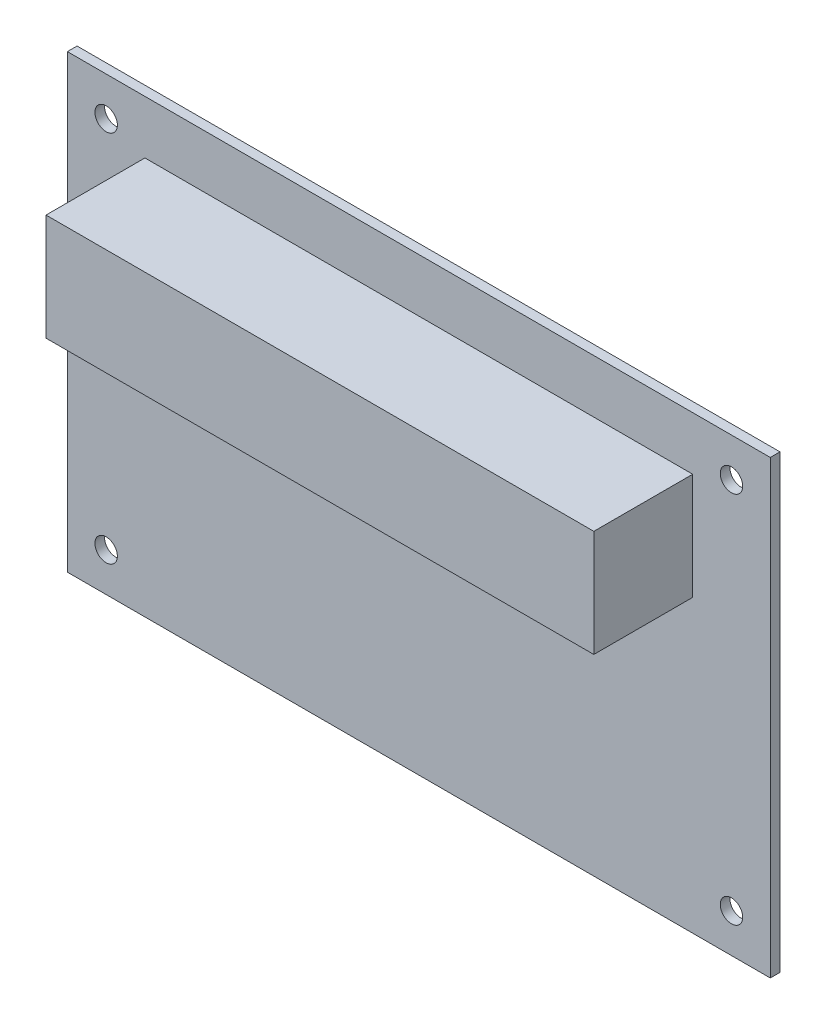
ISO-10303-21;
HEADER;
FILE_DESCRIPTION(('STEP AP214'),'2;1');
FILE_NAME('part.step','',(''),(''),'','','');
FILE_SCHEMA(('AUTOMOTIVE_DESIGN { 1 0 10303 214 1 1 1 1 }'));
ENDSEC;
DATA;
#1=APPLICATION_CONTEXT('core data for automotive mechanical design processes');
#2=APPLICATION_PROTOCOL_DEFINITION('international standard','automotive_design',2000,#1);
#3=PRODUCT_CONTEXT('',#1,'mechanical');
#4=PRODUCT('Part','Part','',(#3));
#5=PRODUCT_RELATED_PRODUCT_CATEGORY('part','',(#4));
#6=PRODUCT_DEFINITION_FORMATION('','',#4);
#7=PRODUCT_DEFINITION_CONTEXT('part definition',#1,'design');
#8=PRODUCT_DEFINITION('design','',#6,#7);
#9=PRODUCT_DEFINITION_SHAPE('','',#8);
#10=(LENGTH_UNIT() NAMED_UNIT(*) SI_UNIT(.MILLI.,.METRE.));
#11=(NAMED_UNIT(*) PLANE_ANGLE_UNIT() SI_UNIT($,.RADIAN.));
#12=(NAMED_UNIT(*) SI_UNIT($,.STERADIAN.) SOLID_ANGLE_UNIT());
#13=UNCERTAINTY_MEASURE_WITH_UNIT(LENGTH_MEASURE(1.E-05),#10,'distance_accuracy_value','');
#14=(GEOMETRIC_REPRESENTATION_CONTEXT(3) GLOBAL_UNCERTAINTY_ASSIGNED_CONTEXT((#13)) GLOBAL_UNIT_ASSIGNED_CONTEXT((#10,
#11,#12)) REPRESENTATION_CONTEXT('',''));
#15=CARTESIAN_POINT('',(0.,0.,0.));
#16=DIRECTION('',(0.,0.,1.));
#17=DIRECTION('',(1.,0.,0.));
#18=AXIS2_PLACEMENT_3D('',#15,#16,#17);
#19=CARTESIAN_POINT('',(0.,0.,1.));
#20=DIRECTION('',(0.,0.,-1.));
#21=DIRECTION('',(-1.,0.,0.));
#22=AXIS2_PLACEMENT_3D('',#19,#20,#21);
#23=PLANE('',#22);
#24=CARTESIAN_POINT('',(-0.272208627681767,4.,1.));
#25=DIRECTION('',(0.,0.,1.));
#26=DIRECTION('',(1.,0.,0.));
#27=AXIS2_PLACEMENT_3D('',#24,#25,#26);
#28=CIRCLE('',#27,1.16);
#29=CARTESIAN_POINT('',(0.887791372318231,4.,1.));
#30=VERTEX_POINT('',#29);
#31=EDGE_CURVE('E128',#30,#30,#28,.T.);
#32=ORIENTED_EDGE('',*,*,#31,.F.);
#33=EDGE_LOOP('',(#32));
#34=FACE_BOUND('',#33,.T.);
#35=CARTESIAN_POINT('',(64.2277913723182,4.,1.));
#36=DIRECTION('',(0.,0.,1.));
#37=DIRECTION('',(1.,0.,0.));
#38=AXIS2_PLACEMENT_3D('',#35,#36,#37);
#39=CIRCLE('',#38,1.15999999999999);
#40=CARTESIAN_POINT('',(65.3877913723182,4.,1.));
#41=VERTEX_POINT('',#40);
#42=EDGE_CURVE('E137',#41,#41,#39,.T.);
#43=ORIENTED_EDGE('',*,*,#42,.F.);
#44=EDGE_LOOP('',(#43));
#45=FACE_BOUND('',#44,.T.);
#46=CARTESIAN_POINT('',(64.2277913723182,42.5,1.));
#47=DIRECTION('',(0.,0.,1.));
#48=DIRECTION('',(1.,0.,0.));
#49=AXIS2_PLACEMENT_3D('',#46,#47,#48);
#50=CIRCLE('',#49,1.15999999999998);
#51=CARTESIAN_POINT('',(65.3877913723182,42.5,1.));
#52=VERTEX_POINT('',#51);
#53=EDGE_CURVE('E143',#52,#52,#50,.T.);
#54=ORIENTED_EDGE('',*,*,#53,.F.);
#55=EDGE_LOOP('',(#54));
#56=FACE_BOUND('',#55,.T.);
#57=CARTESIAN_POINT('',(-0.272208627681767,42.5,1.));
#58=DIRECTION('',(0.,0.,1.));
#59=DIRECTION('',(1.,0.,0.));
#60=AXIS2_PLACEMENT_3D('',#57,#58,#59);
#61=CIRCLE('',#60,1.16);
#62=CARTESIAN_POINT('',(0.887791372318233,42.5,1.));
#63=VERTEX_POINT('',#62);
#64=EDGE_CURVE('E149',#63,#63,#61,.T.);
#65=ORIENTED_EDGE('',*,*,#64,.F.);
#66=EDGE_LOOP('',(#65));
#67=FACE_BOUND('',#66,.T.);
#68=DIRECTION('',(0.,-1.,0.));
#69=VECTOR('',#68,1.);
#70=CARTESIAN_POINT('',(-4.27220862768177,0.,1.));
#71=LINE('',#70,#69);
#72=CARTESIAN_POINT('',(-4.27220862768177,46.5,1.));
#73=VERTEX_POINT('',#72);
#74=CARTESIAN_POINT('',(-4.27220862768177,0.,1.));
#75=VERTEX_POINT('',#74);
#76=EDGE_CURVE('E155',#73,#75,#71,.T.);
#77=ORIENTED_EDGE('',*,*,#76,.T.);
#78=DIRECTION('',(1.,0.,0.));
#79=VECTOR('',#78,1.);
#80=CARTESIAN_POINT('',(-4.27220862768177,0.,1.));
#81=LINE('',#80,#79);
#82=CARTESIAN_POINT('',(68.2277913723182,0.,1.));
#83=VERTEX_POINT('',#82);
#84=EDGE_CURVE('E158',#75,#83,#81,.T.);
#85=ORIENTED_EDGE('',*,*,#84,.T.);
#86=DIRECTION('',(0.,1.,0.));
#87=VECTOR('',#86,1.);
#88=CARTESIAN_POINT('',(68.2277913723182,0.,1.));
#89=LINE('',#88,#87);
#90=CARTESIAN_POINT('',(68.2277913723182,46.5,1.));
#91=VERTEX_POINT('',#90);
#92=EDGE_CURVE('E161',#83,#91,#89,.T.);
#93=ORIENTED_EDGE('',*,*,#92,.T.);
#94=DIRECTION('',(-1.,0.,0.));
#95=VECTOR('',#94,1.);
#96=CARTESIAN_POINT('',(-4.27220862768177,46.5,1.));
#97=LINE('',#96,#95);
#98=EDGE_CURVE('E163',#91,#73,#97,.T.);
#99=ORIENTED_EDGE('',*,*,#98,.T.);
#100=EDGE_LOOP('',(#77,#85,#93,#99));
#101=FACE_BOUND('',#100,.T.);
#102=DIRECTION('',(0.,-1.,0.));
#103=VECTOR('',#102,1.);
#104=CARTESIAN_POINT('',(3.72779137231823,41.,1.));
#105=LINE('',#104,#103);
#106=CARTESIAN_POINT('',(3.72779137231823,41.,1.));
#107=VERTEX_POINT('',#106);
#108=CARTESIAN_POINT('',(3.72779137231823,30.,1.));
#109=VERTEX_POINT('',#108);
#110=EDGE_CURVE('E124',#107,#109,#105,.T.);
#111=ORIENTED_EDGE('',*,*,#110,.F.);
#112=DIRECTION('',(-1.,0.,0.));
#113=VECTOR('',#112,1.);
#114=CARTESIAN_POINT('',(3.72779137231823,41.,1.));
#115=LINE('',#114,#113);
#116=CARTESIAN_POINT('',(60.2277913723182,41.,1.));
#117=VERTEX_POINT('',#116);
#118=EDGE_CURVE('E121',#117,#107,#115,.T.);
#119=ORIENTED_EDGE('',*,*,#118,.F.);
#120=DIRECTION('',(0.,1.,0.));
#121=VECTOR('',#120,1.);
#122=CARTESIAN_POINT('',(60.2277913723182,41.,1.));
#123=LINE('',#122,#121);
#124=CARTESIAN_POINT('',(60.2277913723182,30.,1.));
#125=VERTEX_POINT('',#124);
#126=EDGE_CURVE('E59',#125,#117,#123,.T.);
#127=ORIENTED_EDGE('',*,*,#126,.F.);
#128=DIRECTION('',(1.,0.,0.));
#129=VECTOR('',#128,1.);
#130=CARTESIAN_POINT('',(3.72779137231823,30.,1.));
#131=LINE('',#130,#129);
#132=EDGE_CURVE('E54',#109,#125,#131,.T.);
#133=ORIENTED_EDGE('',*,*,#132,.F.);
#134=EDGE_LOOP('',(#111,#119,#127,#133));
#135=FACE_BOUND('',#134,.T.);
#136=ADVANCED_FACE('F39',(#34,#45,#56,#67,#101,#135),#23,.F.);
#137=CARTESIAN_POINT('',(0.,0.,0.));
#138=DIRECTION('',(0.,0.,-1.));
#139=DIRECTION('',(-1.,0.,0.));
#140=AXIS2_PLACEMENT_3D('',#137,#138,#139);
#141=PLANE('',#140);
#142=CARTESIAN_POINT('',(64.2277913723182,4.,0.));
#143=DIRECTION('',(0.,0.,1.));
#144=DIRECTION('',(1.,0.,0.));
#145=AXIS2_PLACEMENT_3D('',#142,#143,#144);
#146=CIRCLE('',#145,1.15999999999999);
#147=CARTESIAN_POINT('',(65.3877913723182,4.,0.));
#148=VERTEX_POINT('',#147);
#149=EDGE_CURVE('E135',#148,#148,#146,.T.);
#150=ORIENTED_EDGE('',*,*,#149,.T.);
#151=EDGE_LOOP('',(#150));
#152=FACE_BOUND('',#151,.T.);
#153=CARTESIAN_POINT('',(-0.272208627681767,42.5,0.));
#154=DIRECTION('',(0.,0.,1.));
#155=DIRECTION('',(1.,0.,0.));
#156=AXIS2_PLACEMENT_3D('',#153,#154,#155);
#157=CIRCLE('',#156,1.16);
#158=CARTESIAN_POINT('',(0.887791372318233,42.5,0.));
#159=VERTEX_POINT('',#158);
#160=EDGE_CURVE('E146',#159,#159,#157,.T.);
#161=ORIENTED_EDGE('',*,*,#160,.T.);
#162=EDGE_LOOP('',(#161));
#163=FACE_BOUND('',#162,.T.);
#164=DIRECTION('',(0.,-1.,0.));
#165=VECTOR('',#164,1.);
#166=CARTESIAN_POINT('',(-4.27220862768177,0.,0.));
#167=LINE('',#166,#165);
#168=CARTESIAN_POINT('',(-4.27220862768177,46.5,0.));
#169=VERTEX_POINT('',#168);
#170=CARTESIAN_POINT('',(-4.27220862768177,0.,0.));
#171=VERTEX_POINT('',#170);
#172=EDGE_CURVE('E152',#169,#171,#167,.T.);
#173=ORIENTED_EDGE('',*,*,#172,.F.);
#174=DIRECTION('',(-1.,0.,0.));
#175=VECTOR('',#174,1.);
#176=CARTESIAN_POINT('',(-4.27220862768177,46.5,0.));
#177=LINE('',#176,#175);
#178=CARTESIAN_POINT('',(68.2277913723182,46.5,0.));
#179=VERTEX_POINT('',#178);
#180=EDGE_CURVE('E159',#179,#169,#177,.T.);
#181=ORIENTED_EDGE('',*,*,#180,.F.);
#182=DIRECTION('',(0.,1.,0.));
#183=VECTOR('',#182,1.);
#184=CARTESIAN_POINT('',(68.2277913723182,0.,0.));
#185=LINE('',#184,#183);
#186=CARTESIAN_POINT('',(68.2277913723182,0.,0.));
#187=VERTEX_POINT('',#186);
#188=EDGE_CURVE('E170',#187,#179,#185,.T.);
#189=ORIENTED_EDGE('',*,*,#188,.F.);
#190=DIRECTION('',(1.,0.,0.));
#191=VECTOR('',#190,1.);
#192=CARTESIAN_POINT('',(-4.27220862768177,0.,0.));
#193=LINE('',#192,#191);
#194=EDGE_CURVE('E168',#171,#187,#193,.T.);
#195=ORIENTED_EDGE('',*,*,#194,.F.);
#196=EDGE_LOOP('',(#173,#181,#189,#195));
#197=FACE_BOUND('',#196,.T.);
#198=CARTESIAN_POINT('',(64.2277913723182,42.5,0.));
#199=DIRECTION('',(0.,0.,1.));
#200=DIRECTION('',(1.,0.,0.));
#201=AXIS2_PLACEMENT_3D('',#198,#199,#200);
#202=CIRCLE('',#201,1.15999999999998);
#203=CARTESIAN_POINT('',(65.3877913723182,42.5,0.));
#204=VERTEX_POINT('',#203);
#205=EDGE_CURVE('E140',#204,#204,#202,.T.);
#206=ORIENTED_EDGE('',*,*,#205,.T.);
#207=EDGE_LOOP('',(#206));
#208=FACE_BOUND('',#207,.T.);
#209=CARTESIAN_POINT('',(-0.272208627681767,4.,0.));
#210=DIRECTION('',(0.,0.,1.));
#211=DIRECTION('',(1.,0.,0.));
#212=AXIS2_PLACEMENT_3D('',#209,#210,#211);
#213=CIRCLE('',#212,1.16);
#214=CARTESIAN_POINT('',(0.887791372318231,4.,0.));
#215=VERTEX_POINT('',#214);
#216=EDGE_CURVE('E125',#215,#215,#213,.T.);
#217=ORIENTED_EDGE('',*,*,#216,.T.);
#218=EDGE_LOOP('',(#217));
#219=FACE_BOUND('',#218,.T.);
#220=ADVANCED_FACE('F188',(#152,#163,#197,#208,#219),#141,.T.);
#221=CARTESIAN_POINT('',(-4.27220862768177,0.,1.));
#222=DIRECTION('',(1.,0.,0.));
#223=DIRECTION('',(0.,0.,-1.));
#224=AXIS2_PLACEMENT_3D('',#221,#222,#223);
#225=PLANE('',#224);
#226=ORIENTED_EDGE('',*,*,#172,.T.);
#227=DIRECTION('',(0.,0.,-1.));
#228=VECTOR('',#227,1.);
#229=CARTESIAN_POINT('',(-4.27220862768177,0.,1.));
#230=LINE('',#229,#228);
#231=EDGE_CURVE('E11',#75,#171,#230,.T.);
#232=ORIENTED_EDGE('',*,*,#231,.F.);
#233=ORIENTED_EDGE('',*,*,#76,.F.);
#234=DIRECTION('',(0.,0.,-1.));
#235=VECTOR('',#234,1.);
#236=CARTESIAN_POINT('',(-4.27220862768177,46.5,1.));
#237=LINE('',#236,#235);
#238=EDGE_CURVE('E165',#73,#169,#237,.T.);
#239=ORIENTED_EDGE('',*,*,#238,.T.);
#240=EDGE_LOOP('',(#226,#232,#233,#239));
#241=FACE_BOUND('',#240,.T.);
#242=ADVANCED_FACE('F41',(#241),#225,.F.);
#243=CARTESIAN_POINT('',(-4.27220862768177,0.,1.));
#244=DIRECTION('',(0.,1.,0.));
#245=DIRECTION('',(0.,0.,1.));
#246=AXIS2_PLACEMENT_3D('',#243,#244,#245);
#247=PLANE('',#246);
#248=ORIENTED_EDGE('',*,*,#194,.T.);
#249=DIRECTION('',(0.,0.,-1.));
#250=VECTOR('',#249,1.);
#251=CARTESIAN_POINT('',(68.2277913723182,0.,1.));
#252=LINE('',#251,#250);
#253=EDGE_CURVE('E47',#83,#187,#252,.T.);
#254=ORIENTED_EDGE('',*,*,#253,.F.);
#255=ORIENTED_EDGE('',*,*,#84,.F.);
#256=ORIENTED_EDGE('',*,*,#231,.T.);
#257=EDGE_LOOP('',(#248,#254,#255,#256));
#258=FACE_BOUND('',#257,.T.);
#259=ADVANCED_FACE('F198',(#258),#247,.F.);
#260=CARTESIAN_POINT('',(68.2277913723182,0.,1.));
#261=DIRECTION('',(-1.,0.,0.));
#262=DIRECTION('',(0.,0.,1.));
#263=AXIS2_PLACEMENT_3D('',#260,#261,#262);
#264=PLANE('',#263);
#265=ORIENTED_EDGE('',*,*,#188,.T.);
#266=DIRECTION('',(0.,0.,-1.));
#267=VECTOR('',#266,1.);
#268=CARTESIAN_POINT('',(68.2277913723182,46.5,1.));
#269=LINE('',#268,#267);
#270=EDGE_CURVE('E175',#91,#179,#269,.T.);
#271=ORIENTED_EDGE('',*,*,#270,.F.);
#272=ORIENTED_EDGE('',*,*,#92,.F.);
#273=ORIENTED_EDGE('',*,*,#253,.T.);
#274=EDGE_LOOP('',(#265,#271,#272,#273));
#275=FACE_BOUND('',#274,.T.);
#276=ADVANCED_FACE('F182',(#275),#264,.F.);
#277=CARTESIAN_POINT('',(-4.27220862768177,46.5,1.));
#278=DIRECTION('',(0.,-1.,0.));
#279=DIRECTION('',(0.,0.,-1.));
#280=AXIS2_PLACEMENT_3D('',#277,#278,#279);
#281=PLANE('',#280);
#282=ORIENTED_EDGE('',*,*,#180,.T.);
#283=ORIENTED_EDGE('',*,*,#238,.F.);
#284=ORIENTED_EDGE('',*,*,#98,.F.);
#285=ORIENTED_EDGE('',*,*,#270,.T.);
#286=EDGE_LOOP('',(#282,#283,#284,#285));
#287=FACE_BOUND('',#286,.T.);
#288=ADVANCED_FACE('F192',(#287),#281,.F.);
#289=CARTESIAN_POINT('',(-0.272208627681767,42.5,1.));
#290=DIRECTION('',(0.,0.,-1.));
#291=DIRECTION('',(-1.,0.,0.));
#292=AXIS2_PLACEMENT_3D('',#289,#290,#291);
#293=CYLINDRICAL_SURFACE('',#292,1.16);
#294=ORIENTED_EDGE('',*,*,#64,.T.);
#295=EDGE_LOOP('',(#294));
#296=FACE_BOUND('',#295,.T.);
#297=ORIENTED_EDGE('',*,*,#160,.F.);
#298=EDGE_LOOP('',(#297));
#299=FACE_BOUND('',#298,.T.);
#300=ADVANCED_FACE('F218',(#296,#299),#293,.F.);
#301=CARTESIAN_POINT('',(64.2277913723182,42.5,1.));
#302=DIRECTION('',(0.,0.,-1.));
#303=DIRECTION('',(-1.,0.,0.));
#304=AXIS2_PLACEMENT_3D('',#301,#302,#303);
#305=CYLINDRICAL_SURFACE('',#304,1.15999999999998);
#306=ORIENTED_EDGE('',*,*,#53,.T.);
#307=EDGE_LOOP('',(#306));
#308=FACE_BOUND('',#307,.T.);
#309=ORIENTED_EDGE('',*,*,#205,.F.);
#310=EDGE_LOOP('',(#309));
#311=FACE_BOUND('',#310,.T.);
#312=ADVANCED_FACE('F225',(#308,#311),#305,.F.);
#313=CARTESIAN_POINT('',(64.2277913723182,4.,1.));
#314=DIRECTION('',(0.,0.,-1.));
#315=DIRECTION('',(-1.,0.,0.));
#316=AXIS2_PLACEMENT_3D('',#313,#314,#315);
#317=CYLINDRICAL_SURFACE('',#316,1.15999999999999);
#318=ORIENTED_EDGE('',*,*,#42,.T.);
#319=EDGE_LOOP('',(#318));
#320=FACE_BOUND('',#319,.T.);
#321=ORIENTED_EDGE('',*,*,#149,.F.);
#322=EDGE_LOOP('',(#321));
#323=FACE_BOUND('',#322,.T.);
#324=ADVANCED_FACE('F230',(#320,#323),#317,.F.);
#325=CARTESIAN_POINT('',(-0.272208627681767,4.,1.));
#326=DIRECTION('',(0.,0.,-1.));
#327=DIRECTION('',(-1.,0.,0.));
#328=AXIS2_PLACEMENT_3D('',#325,#326,#327);
#329=CYLINDRICAL_SURFACE('',#328,1.16);
#330=ORIENTED_EDGE('',*,*,#31,.T.);
#331=EDGE_LOOP('',(#330));
#332=FACE_BOUND('',#331,.T.);
#333=ORIENTED_EDGE('',*,*,#216,.F.);
#334=EDGE_LOOP('',(#333));
#335=FACE_BOUND('',#334,.T.);
#336=ADVANCED_FACE('F240',(#332,#335),#329,.F.);
#337=CARTESIAN_POINT('',(3.72779137231823,41.,11.2));
#338=DIRECTION('',(1.,0.,0.));
#339=DIRECTION('',(0.,1.,0.));
#340=AXIS2_PLACEMENT_3D('',#337,#338,#339);
#341=PLANE('',#340);
#342=ORIENTED_EDGE('',*,*,#110,.T.);
#343=DIRECTION('',(0.,0.,-1.));
#344=VECTOR('',#343,1.);
#345=CARTESIAN_POINT('',(3.72779137231823,30.,11.2));
#346=LINE('',#345,#344);
#347=CARTESIAN_POINT('',(3.72779137231823,30.,11.2));
#348=VERTEX_POINT('',#347);
#349=EDGE_CURVE('E105',#348,#109,#346,.T.);
#350=ORIENTED_EDGE('',*,*,#349,.F.);
#351=DIRECTION('',(0.,-1.,0.));
#352=VECTOR('',#351,1.);
#353=CARTESIAN_POINT('',(3.72779137231823,41.,11.2));
#354=LINE('',#353,#352);
#355=CARTESIAN_POINT('',(3.72779137231823,41.,11.2));
#356=VERTEX_POINT('',#355);
#357=EDGE_CURVE('E112',#356,#348,#354,.T.);
#358=ORIENTED_EDGE('',*,*,#357,.F.);
#359=DIRECTION('',(0.,0.,-1.));
#360=VECTOR('',#359,1.);
#361=CARTESIAN_POINT('',(3.72779137231823,41.,11.2));
#362=LINE('',#361,#360);
#363=EDGE_CURVE('E341',#356,#107,#362,.T.);
#364=ORIENTED_EDGE('',*,*,#363,.T.);
#365=EDGE_LOOP('',(#342,#350,#358,#364));
#366=FACE_BOUND('',#365,.T.);
#367=ADVANCED_FACE('F123',(#366),#341,.F.);
#368=CARTESIAN_POINT('',(3.72779137231823,30.,11.2));
#369=DIRECTION('',(0.,1.,0.));
#370=DIRECTION('',(0.,0.,1.));
#371=AXIS2_PLACEMENT_3D('',#368,#369,#370);
#372=PLANE('',#371);
#373=ORIENTED_EDGE('',*,*,#132,.T.);
#374=DIRECTION('',(0.,0.,-1.));
#375=VECTOR('',#374,1.);
#376=CARTESIAN_POINT('',(60.2277913723182,30.,11.2));
#377=LINE('',#376,#375);
#378=CARTESIAN_POINT('',(60.2277913723182,30.,11.2));
#379=VERTEX_POINT('',#378);
#380=EDGE_CURVE('E108',#379,#125,#377,.T.);
#381=ORIENTED_EDGE('',*,*,#380,.F.);
#382=DIRECTION('',(1.,0.,0.));
#383=VECTOR('',#382,1.);
#384=CARTESIAN_POINT('',(3.72779137231823,30.,11.2));
#385=LINE('',#384,#383);
#386=EDGE_CURVE('E101',#348,#379,#385,.T.);
#387=ORIENTED_EDGE('',*,*,#386,.F.);
#388=ORIENTED_EDGE('',*,*,#349,.T.);
#389=EDGE_LOOP('',(#373,#381,#387,#388));
#390=FACE_BOUND('',#389,.T.);
#391=ADVANCED_FACE('F103',(#390),#372,.F.);
#392=CARTESIAN_POINT('',(60.2277913723182,41.,11.2));
#393=DIRECTION('',(-1.,0.,0.));
#394=DIRECTION('',(0.,0.,1.));
#395=AXIS2_PLACEMENT_3D('',#392,#393,#394);
#396=PLANE('',#395);
#397=ORIENTED_EDGE('',*,*,#126,.T.);
#398=DIRECTION('',(0.,0.,-1.));
#399=VECTOR('',#398,1.);
#400=CARTESIAN_POINT('',(60.2277913723182,41.,11.2));
#401=LINE('',#400,#399);
#402=CARTESIAN_POINT('',(60.2277913723182,41.,11.2));
#403=VERTEX_POINT('',#402);
#404=EDGE_CURVE('E130',#403,#117,#401,.T.);
#405=ORIENTED_EDGE('',*,*,#404,.F.);
#406=DIRECTION('',(0.,1.,0.));
#407=VECTOR('',#406,1.);
#408=CARTESIAN_POINT('',(60.2277913723182,41.,11.2));
#409=LINE('',#408,#407);
#410=EDGE_CURVE('E111',#379,#403,#409,.T.);
#411=ORIENTED_EDGE('',*,*,#410,.F.);
#412=ORIENTED_EDGE('',*,*,#380,.T.);
#413=EDGE_LOOP('',(#397,#405,#411,#412));
#414=FACE_BOUND('',#413,.T.);
#415=ADVANCED_FACE('F250',(#414),#396,.F.);
#416=CARTESIAN_POINT('',(3.72779137231823,41.,11.2));
#417=DIRECTION('',(0.,-1.,0.));
#418=DIRECTION('',(0.,0.,-1.));
#419=AXIS2_PLACEMENT_3D('',#416,#417,#418);
#420=PLANE('',#419);
#421=ORIENTED_EDGE('',*,*,#118,.T.);
#422=ORIENTED_EDGE('',*,*,#363,.F.);
#423=DIRECTION('',(-1.,0.,0.));
#424=VECTOR('',#423,1.);
#425=CARTESIAN_POINT('',(3.72779137231823,41.,11.2));
#426=LINE('',#425,#424);
#427=EDGE_CURVE('E117',#403,#356,#426,.T.);
#428=ORIENTED_EDGE('',*,*,#427,.F.);
#429=ORIENTED_EDGE('',*,*,#404,.T.);
#430=EDGE_LOOP('',(#421,#422,#428,#429));
#431=FACE_BOUND('',#430,.T.);
#432=ADVANCED_FACE('F253',(#431),#420,.F.);
#433=CARTESIAN_POINT('',(0.,0.,11.2));
#434=DIRECTION('',(0.,0.,1.));
#435=DIRECTION('',(1.,0.,0.));
#436=AXIS2_PLACEMENT_3D('',#433,#434,#435);
#437=PLANE('',#436);
#438=ORIENTED_EDGE('',*,*,#357,.T.);
#439=ORIENTED_EDGE('',*,*,#386,.T.);
#440=ORIENTED_EDGE('',*,*,#410,.T.);
#441=ORIENTED_EDGE('',*,*,#427,.T.);
#442=EDGE_LOOP('',(#438,#439,#440,#441));
#443=FACE_BOUND('',#442,.T.);
#444=ADVANCED_FACE('F115',(#443),#437,.T.);
#445=CLOSED_SHELL('',(#136,#220,#242,#259,#276,#288,#300,#312,#324,#336,#367,#391,#415,#432,#444));
#446=MANIFOLD_SOLID_BREP('B2',#445);
#447=ADVANCED_BREP_SHAPE_REPRESENTATION('',(#18,#446),#14);
#448=SHAPE_DEFINITION_REPRESENTATION(#9,#447);
ENDSEC;
END-ISO-10303-21;
